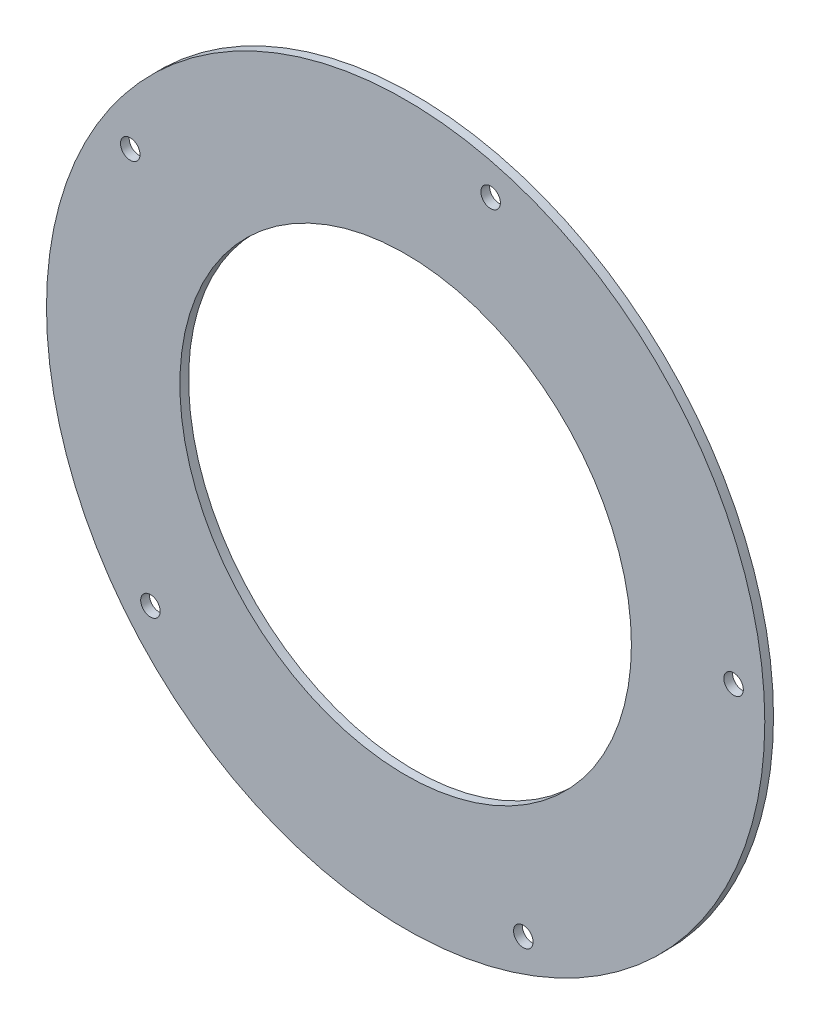
ISO-10303-21;
HEADER;
FILE_DESCRIPTION(('STEP AP214'),'2;1');
FILE_NAME('part.step','',(''),(''),'','','');
FILE_SCHEMA(('AUTOMOTIVE_DESIGN { 1 0 10303 214 1 1 1 1 }'));
ENDSEC;
DATA;
#1=APPLICATION_CONTEXT('core data for automotive mechanical design processes');
#2=APPLICATION_PROTOCOL_DEFINITION('international standard','automotive_design',2000,#1);
#3=PRODUCT_CONTEXT('',#1,'mechanical');
#4=PRODUCT('Part','Part','',(#3));
#5=PRODUCT_RELATED_PRODUCT_CATEGORY('part','',(#4));
#6=PRODUCT_DEFINITION_FORMATION('','',#4);
#7=PRODUCT_DEFINITION_CONTEXT('part definition',#1,'design');
#8=PRODUCT_DEFINITION('design','',#6,#7);
#9=PRODUCT_DEFINITION_SHAPE('','',#8);
#10=(LENGTH_UNIT() NAMED_UNIT(*) SI_UNIT(.MILLI.,.METRE.));
#11=(NAMED_UNIT(*) PLANE_ANGLE_UNIT() SI_UNIT($,.RADIAN.));
#12=(NAMED_UNIT(*) SI_UNIT($,.STERADIAN.) SOLID_ANGLE_UNIT());
#13=UNCERTAINTY_MEASURE_WITH_UNIT(LENGTH_MEASURE(1.E-05),#10,'distance_accuracy_value','');
#14=(GEOMETRIC_REPRESENTATION_CONTEXT(3) GLOBAL_UNCERTAINTY_ASSIGNED_CONTEXT((#13)) GLOBAL_UNIT_ASSIGNED_CONTEXT((#10,
#11,#12)) REPRESENTATION_CONTEXT('',''));
#15=CARTESIAN_POINT('',(0.,0.,0.));
#16=DIRECTION('',(0.,0.,1.));
#17=DIRECTION('',(1.,0.,0.));
#18=AXIS2_PLACEMENT_3D('',#15,#16,#17);
#19=CARTESIAN_POINT('',(0.,0.,1.3));
#20=DIRECTION('',(0.,0.,-1.));
#21=DIRECTION('',(-1.,0.,0.));
#22=AXIS2_PLACEMENT_3D('',#19,#20,#21);
#23=CYLINDRICAL_SURFACE('',#22,35.);
#24=CARTESIAN_POINT('',(0.,0.,1.55));
#25=DIRECTION('',(0.,0.,1.));
#26=DIRECTION('',(1.,0.,0.));
#27=AXIS2_PLACEMENT_3D('',#24,#25,#26);
#28=CIRCLE('',#27,35.);
#29=CARTESIAN_POINT('',(35.,0.,1.55));
#30=VERTEX_POINT('',#29);
#31=EDGE_CURVE('E11',#30,#30,#28,.T.);
#32=ORIENTED_EDGE('',*,*,#31,.F.);
#33=EDGE_LOOP('',(#32));
#34=FACE_BOUND('',#33,.T.);
#35=CARTESIAN_POINT('',(0.,0.,0.7));
#36=DIRECTION('',(0.,0.,1.));
#37=DIRECTION('',(1.,0.,0.));
#38=AXIS2_PLACEMENT_3D('',#35,#36,#37);
#39=CIRCLE('',#38,35.);
#40=CARTESIAN_POINT('',(35.,0.,0.7));
#41=VERTEX_POINT('',#40);
#42=EDGE_CURVE('E42',#41,#41,#39,.T.);
#43=ORIENTED_EDGE('',*,*,#42,.T.);
#44=EDGE_LOOP('',(#43));
#45=FACE_BOUND('',#44,.T.);
#46=ADVANCED_FACE('F35',(#34,#45),#23,.T.);
#47=CARTESIAN_POINT('',(0.,0.,1.55));
#48=DIRECTION('',(0.,0.,1.));
#49=DIRECTION('',(1.,0.,0.));
#50=AXIS2_PLACEMENT_3D('',#47,#48,#49);
#51=PLANE('',#50);
#52=CARTESIAN_POINT('',(-26.8374581742536,17.4284491204808,1.55));
#53=DIRECTION('',(0.,0.,1.));
#54=DIRECTION('',(1.,0.,0.));
#55=AXIS2_PLACEMENT_3D('',#52,#53,#54);
#56=CIRCLE('',#55,0.949999999999999);
#57=CARTESIAN_POINT('',(-25.8874581742536,17.4284491204808,1.55));
#58=VERTEX_POINT('',#57);
#59=EDGE_CURVE('E55',#58,#58,#56,.T.);
#60=ORIENTED_EDGE('',*,*,#59,.F.);
#61=EDGE_LOOP('',(#60));
#62=FACE_BOUND('',#61,.T.);
#63=CARTESIAN_POINT('',(-24.868670766623,-20.1382525135949,1.55));
#64=DIRECTION('',(0.,0.,1.));
#65=DIRECTION('',(1.,0.,0.));
#66=AXIS2_PLACEMENT_3D('',#63,#64,#65);
#67=CIRCLE('',#66,0.949999999999999);
#68=CARTESIAN_POINT('',(-23.918670766623,-20.1382525135949,1.55));
#69=VERTEX_POINT('',#68);
#70=EDGE_CURVE('E60',#69,#69,#67,.T.);
#71=ORIENTED_EDGE('',*,*,#70,.F.);
#72=EDGE_LOOP('',(#71));
#73=FACE_BOUND('',#72,.T.);
#74=CARTESIAN_POINT('',(11.4677743854499,-29.8745736479104,1.55));
#75=DIRECTION('',(0.,0.,1.));
#76=DIRECTION('',(1.,0.,0.));
#77=AXIS2_PLACEMENT_3D('',#74,#75,#76);
#78=CIRCLE('',#77,0.949999999999999);
#79=CARTESIAN_POINT('',(12.4177743854499,-29.8745736479104,1.55));
#80=VERTEX_POINT('',#79);
#81=EDGE_CURVE('E64',#80,#80,#78,.T.);
#82=ORIENTED_EDGE('',*,*,#81,.F.);
#83=EDGE_LOOP('',(#82));
#84=FACE_BOUND('',#83,.T.);
#85=CARTESIAN_POINT('',(31.9561451121464,1.67475059977455,1.55));
#86=DIRECTION('',(0.,0.,1.));
#87=DIRECTION('',(1.,0.,0.));
#88=AXIS2_PLACEMENT_3D('',#85,#86,#87);
#89=CIRCLE('',#88,0.949999999999999);
#90=CARTESIAN_POINT('',(32.9061451121464,1.67475059977455,1.55));
#91=VERTEX_POINT('',#90);
#92=EDGE_CURVE('E68',#91,#91,#89,.T.);
#93=ORIENTED_EDGE('',*,*,#92,.F.);
#94=EDGE_LOOP('',(#93));
#95=FACE_BOUND('',#94,.T.);
#96=CARTESIAN_POINT('',(8.28220944328068,30.9096264412502,1.55));
#97=DIRECTION('',(0.,0.,1.));
#98=DIRECTION('',(1.,0.,0.));
#99=AXIS2_PLACEMENT_3D('',#96,#97,#98);
#100=CIRCLE('',#99,0.949999999999999);
#101=CARTESIAN_POINT('',(9.23220944328068,30.9096264412502,1.55));
#102=VERTEX_POINT('',#101);
#103=EDGE_CURVE('E71',#102,#102,#100,.T.);
#104=ORIENTED_EDGE('',*,*,#103,.F.);
#105=EDGE_LOOP('',(#104));
#106=FACE_BOUND('',#105,.T.);
#107=CARTESIAN_POINT('',(0.,0.,1.55));
#108=DIRECTION('',(0.,0.,1.));
#109=DIRECTION('',(1.,0.,0.));
#110=AXIS2_PLACEMENT_3D('',#107,#108,#109);
#111=CIRCLE('',#110,22.);
#112=CARTESIAN_POINT('',(22.,0.,1.55));
#113=VERTEX_POINT('',#112);
#114=EDGE_CURVE('E51',#113,#113,#111,.T.);
#115=ORIENTED_EDGE('',*,*,#114,.F.);
#116=EDGE_LOOP('',(#115));
#117=FACE_BOUND('',#116,.T.);
#118=ORIENTED_EDGE('',*,*,#31,.T.);
#119=EDGE_LOOP('',(#118));
#120=FACE_BOUND('',#119,.T.);
#121=ADVANCED_FACE('F37',(#62,#73,#84,#95,#106,#117,#120),#51,.T.);
#122=CARTESIAN_POINT('',(0.,0.,0.7));
#123=DIRECTION('',(0.,0.,1.));
#124=DIRECTION('',(1.,0.,0.));
#125=AXIS2_PLACEMENT_3D('',#122,#123,#124);
#126=PLANE('',#125);
#127=CARTESIAN_POINT('',(-26.8374581742536,17.4284491204808,0.7));
#128=DIRECTION('',(0.,0.,1.));
#129=DIRECTION('',(0.309016994374945,0.951056516295155,0.));
#130=AXIS2_PLACEMENT_3D('',#127,#128,#129);
#131=CIRCLE('',#130,0.949999999999999);
#132=CARTESIAN_POINT('',(-26.5438920295974,18.3319528109612,0.7));
#133=VERTEX_POINT('',#132);
#134=EDGE_CURVE('E58',#133,#133,#131,.T.);
#135=ORIENTED_EDGE('',*,*,#134,.T.);
#136=EDGE_LOOP('',(#135));
#137=FACE_BOUND('',#136,.T.);
#138=CARTESIAN_POINT('',(-24.868670766623,-20.1382525135949,0.7));
#139=DIRECTION('',(0.,0.,1.));
#140=DIRECTION('',(-0.809016994374951,0.587785252292469,0.));
#141=AXIS2_PLACEMENT_3D('',#138,#139,#140);
#142=CIRCLE('',#141,0.949999999999999);
#143=CARTESIAN_POINT('',(-25.6372369112792,-19.5798565239171,0.7));
#144=VERTEX_POINT('',#143);
#145=EDGE_CURVE('E59',#144,#144,#142,.T.);
#146=ORIENTED_EDGE('',*,*,#145,.T.);
#147=EDGE_LOOP('',(#146));
#148=FACE_BOUND('',#147,.T.);
#149=CARTESIAN_POINT('',(11.4677743854499,-29.8745736479104,0.7));
#150=DIRECTION('',(0.,0.,1.));
#151=DIRECTION('',(-0.809016994374942,-0.58778525229248,0.));
#152=AXIS2_PLACEMENT_3D('',#149,#150,#151);
#153=CIRCLE('',#152,0.949999999999999);
#154=CARTESIAN_POINT('',(10.6992082407937,-30.4329696375882,0.7));
#155=VERTEX_POINT('',#154);
#156=EDGE_CURVE('E63',#155,#155,#153,.T.);
#157=ORIENTED_EDGE('',*,*,#156,.T.);
#158=EDGE_LOOP('',(#157));
#159=FACE_BOUND('',#158,.T.);
#160=CARTESIAN_POINT('',(31.9561451121464,1.67475059977455,0.7));
#161=DIRECTION('',(0.,0.,1.));
#162=DIRECTION('',(0.309016994374958,-0.95105651629515,0.));
#163=AXIS2_PLACEMENT_3D('',#160,#161,#162);
#164=CIRCLE('',#163,0.949999999999999);
#165=CARTESIAN_POINT('',(32.2497112568026,0.771246909294154,0.7));
#166=VERTEX_POINT('',#165);
#167=EDGE_CURVE('E67',#166,#166,#164,.T.);
#168=ORIENTED_EDGE('',*,*,#167,.T.);
#169=EDGE_LOOP('',(#168));
#170=FACE_BOUND('',#169,.T.);
#171=CARTESIAN_POINT('',(8.28220944328068,30.9096264412502,0.7));
#172=DIRECTION('',(0.,0.,1.));
#173=DIRECTION('',(1.,0.,0.));
#174=AXIS2_PLACEMENT_3D('',#171,#172,#173);
#175=CIRCLE('',#174,0.949999999999999);
#176=CARTESIAN_POINT('',(9.23220944328068,30.9096264412502,0.7));
#177=VERTEX_POINT('',#176);
#178=EDGE_CURVE('E73',#177,#177,#175,.T.);
#179=ORIENTED_EDGE('',*,*,#178,.T.);
#180=EDGE_LOOP('',(#179));
#181=FACE_BOUND('',#180,.T.);
#182=CARTESIAN_POINT('',(0.,0.,0.7));
#183=DIRECTION('',(0.,0.,1.));
#184=DIRECTION('',(1.,0.,0.));
#185=AXIS2_PLACEMENT_3D('',#182,#183,#184);
#186=CIRCLE('',#185,22.);
#187=CARTESIAN_POINT('',(22.,0.,0.7));
#188=VERTEX_POINT('',#187);
#189=EDGE_CURVE('E46',#188,#188,#186,.T.);
#190=ORIENTED_EDGE('',*,*,#189,.T.);
#191=EDGE_LOOP('',(#190));
#192=FACE_BOUND('',#191,.T.);
#193=ORIENTED_EDGE('',*,*,#42,.F.);
#194=EDGE_LOOP('',(#193));
#195=FACE_BOUND('',#194,.T.);
#196=ADVANCED_FACE('F90',(#137,#148,#159,#170,#181,#192,#195),#126,.F.);
#197=CARTESIAN_POINT('',(0.,0.,0.));
#198=DIRECTION('',(0.,0.,1.));
#199=DIRECTION('',(1.,0.,0.));
#200=AXIS2_PLACEMENT_3D('',#197,#198,#199);
#201=CYLINDRICAL_SURFACE('',#200,22.);
#202=ORIENTED_EDGE('',*,*,#189,.F.);
#203=EDGE_LOOP('',(#202));
#204=FACE_BOUND('',#203,.T.);
#205=ORIENTED_EDGE('',*,*,#114,.T.);
#206=EDGE_LOOP('',(#205));
#207=FACE_BOUND('',#206,.T.);
#208=ADVANCED_FACE('F114',(#204,#207),#201,.F.);
#209=CARTESIAN_POINT('',(8.28220944328068,30.9096264412502,0.7));
#210=DIRECTION('',(0.,0.,1.));
#211=DIRECTION('',(1.,0.,0.));
#212=AXIS2_PLACEMENT_3D('',#209,#210,#211);
#213=CYLINDRICAL_SURFACE('',#212,0.949999999999999);
#214=ORIENTED_EDGE('',*,*,#178,.F.);
#215=EDGE_LOOP('',(#214));
#216=FACE_BOUND('',#215,.T.);
#217=ORIENTED_EDGE('',*,*,#103,.T.);
#218=EDGE_LOOP('',(#217));
#219=FACE_BOUND('',#218,.T.);
#220=ADVANCED_FACE('F111',(#216,#219),#213,.F.);
#221=CARTESIAN_POINT('',(31.9561451121464,1.67475059977455,0.7));
#222=DIRECTION('',(0.,0.,1.));
#223=DIRECTION('',(1.,0.,0.));
#224=AXIS2_PLACEMENT_3D('',#221,#222,#223);
#225=CYLINDRICAL_SURFACE('',#224,0.949999999999999);
#226=ORIENTED_EDGE('',*,*,#167,.F.);
#227=EDGE_LOOP('',(#226));
#228=FACE_BOUND('',#227,.T.);
#229=ORIENTED_EDGE('',*,*,#92,.T.);
#230=EDGE_LOOP('',(#229));
#231=FACE_BOUND('',#230,.T.);
#232=ADVANCED_FACE('F113',(#228,#231),#225,.F.);
#233=CARTESIAN_POINT('',(11.4677743854499,-29.8745736479104,0.7));
#234=DIRECTION('',(0.,0.,1.));
#235=DIRECTION('',(1.,0.,0.));
#236=AXIS2_PLACEMENT_3D('',#233,#234,#235);
#237=CYLINDRICAL_SURFACE('',#236,0.949999999999999);
#238=ORIENTED_EDGE('',*,*,#156,.F.);
#239=EDGE_LOOP('',(#238));
#240=FACE_BOUND('',#239,.T.);
#241=ORIENTED_EDGE('',*,*,#81,.T.);
#242=EDGE_LOOP('',(#241));
#243=FACE_BOUND('',#242,.T.);
#244=ADVANCED_FACE('F121',(#240,#243),#237,.F.);
#245=CARTESIAN_POINT('',(-24.868670766623,-20.1382525135949,0.7));
#246=DIRECTION('',(0.,0.,1.));
#247=DIRECTION('',(1.,0.,0.));
#248=AXIS2_PLACEMENT_3D('',#245,#246,#247);
#249=CYLINDRICAL_SURFACE('',#248,0.949999999999999);
#250=ORIENTED_EDGE('',*,*,#145,.F.);
#251=EDGE_LOOP('',(#250));
#252=FACE_BOUND('',#251,.T.);
#253=ORIENTED_EDGE('',*,*,#70,.T.);
#254=EDGE_LOOP('',(#253));
#255=FACE_BOUND('',#254,.T.);
#256=ADVANCED_FACE('F96',(#252,#255),#249,.F.);
#257=CARTESIAN_POINT('',(-26.8374581742536,17.4284491204808,0.7));
#258=DIRECTION('',(0.,0.,1.));
#259=DIRECTION('',(1.,0.,0.));
#260=AXIS2_PLACEMENT_3D('',#257,#258,#259);
#261=CYLINDRICAL_SURFACE('',#260,0.949999999999999);
#262=ORIENTED_EDGE('',*,*,#134,.F.);
#263=EDGE_LOOP('',(#262));
#264=FACE_BOUND('',#263,.T.);
#265=ORIENTED_EDGE('',*,*,#59,.T.);
#266=EDGE_LOOP('',(#265));
#267=FACE_BOUND('',#266,.T.);
#268=ADVANCED_FACE('F93',(#264,#267),#261,.F.);
#269=CLOSED_SHELL('',(#46,#121,#196,#208,#220,#232,#244,#256,#268));
#270=MANIFOLD_SOLID_BREP('B2',#269);
#271=ADVANCED_BREP_SHAPE_REPRESENTATION('',(#18,#270),#14);
#272=SHAPE_DEFINITION_REPRESENTATION(#9,#271);
ENDSEC;
END-ISO-10303-21;
